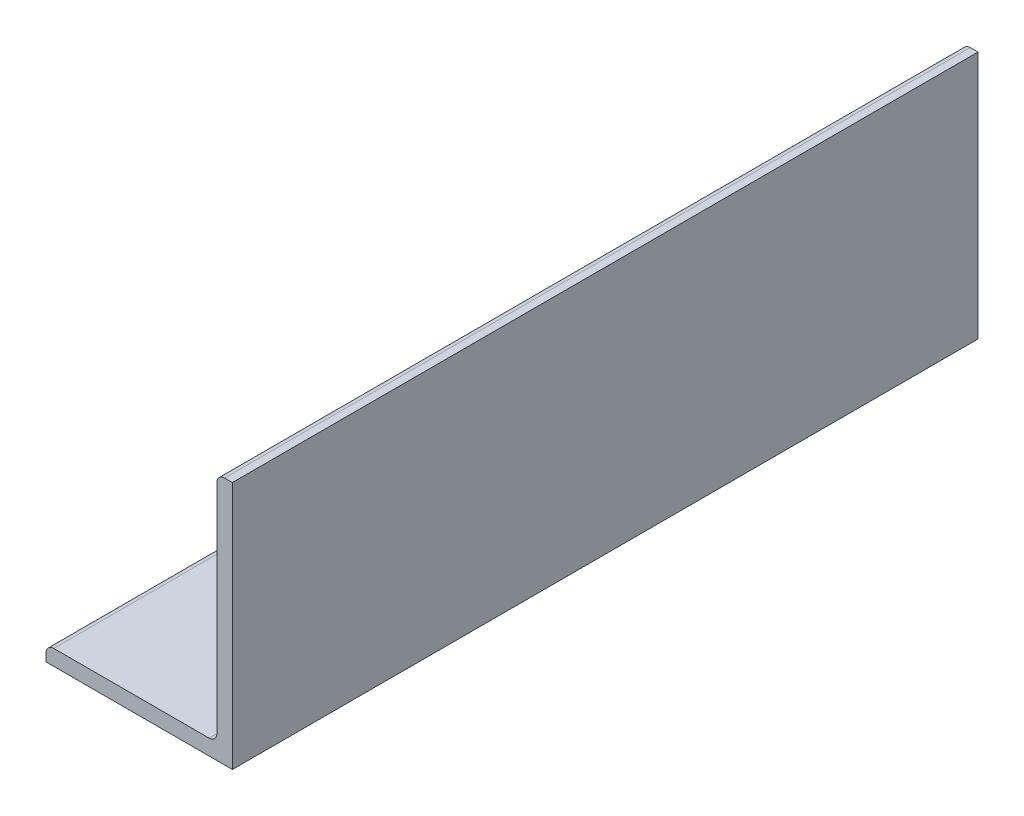
ISO-10303-21;
HEADER;
FILE_DESCRIPTION(('STEP AP214'),'2;1');
FILE_NAME('part.step','',(''),(''),'','','');
FILE_SCHEMA(('AUTOMOTIVE_DESIGN { 1 0 10303 214 1 1 1 1 }'));
ENDSEC;
DATA;
#1=APPLICATION_CONTEXT('core data for automotive mechanical design processes');
#2=APPLICATION_PROTOCOL_DEFINITION('international standard','automotive_design',2000,#1);
#3=PRODUCT_CONTEXT('',#1,'mechanical');
#4=PRODUCT('Part','Part','',(#3));
#5=PRODUCT_RELATED_PRODUCT_CATEGORY('part','',(#4));
#6=PRODUCT_DEFINITION_FORMATION('','',#4);
#7=PRODUCT_DEFINITION_CONTEXT('part definition',#1,'design');
#8=PRODUCT_DEFINITION('design','',#6,#7);
#9=PRODUCT_DEFINITION_SHAPE('','',#8);
#10=(LENGTH_UNIT() NAMED_UNIT(*) SI_UNIT(.MILLI.,.METRE.));
#11=(NAMED_UNIT(*) PLANE_ANGLE_UNIT() SI_UNIT($,.RADIAN.));
#12=(NAMED_UNIT(*) SI_UNIT($,.STERADIAN.) SOLID_ANGLE_UNIT());
#13=UNCERTAINTY_MEASURE_WITH_UNIT(LENGTH_MEASURE(1.E-05),#10,'distance_accuracy_value','');
#14=(GEOMETRIC_REPRESENTATION_CONTEXT(3) GLOBAL_UNCERTAINTY_ASSIGNED_CONTEXT((#13)) GLOBAL_UNIT_ASSIGNED_CONTEXT((#10,
#11,#12)) REPRESENTATION_CONTEXT('',''));
#15=CARTESIAN_POINT('',(0.,0.,0.));
#16=DIRECTION('',(0.,0.,1.));
#17=DIRECTION('',(1.,0.,0.));
#18=AXIS2_PLACEMENT_3D('',#15,#16,#17);
#19=CARTESIAN_POINT('',(-38.1,3.175,152.4));
#20=DIRECTION('',(1.,0.,0.));
#21=DIRECTION('',(0.,0.,-1.));
#22=AXIS2_PLACEMENT_3D('',#19,#20,#21);
#23=PLANE('',#22);
#24=DIRECTION('',(0.,-1.,0.));
#25=VECTOR('',#24,1.);
#26=CARTESIAN_POINT('',(-38.1,3.175,-152.4));
#27=LINE('',#26,#25);
#28=CARTESIAN_POINT('',(-38.1,3.175,-152.4));
#29=VERTEX_POINT('',#28);
#30=CARTESIAN_POINT('',(-38.1,0.,-152.4));
#31=VERTEX_POINT('',#30);
#32=EDGE_CURVE('E134',#29,#31,#27,.T.);
#33=ORIENTED_EDGE('',*,*,#32,.T.);
#34=DIRECTION('',(0.,0.,-1.));
#35=VECTOR('',#34,1.);
#36=CARTESIAN_POINT('',(-38.1,0.,152.4));
#37=LINE('',#36,#35);
#38=CARTESIAN_POINT('',(-38.1,0.,152.4));
#39=VERTEX_POINT('',#38);
#40=EDGE_CURVE('E11',#39,#31,#37,.T.);
#41=ORIENTED_EDGE('',*,*,#40,.F.);
#42=DIRECTION('',(0.,-1.,0.));
#43=VECTOR('',#42,1.);
#44=CARTESIAN_POINT('',(-38.1,3.175,152.4));
#45=LINE('',#44,#43);
#46=CARTESIAN_POINT('',(-38.1,3.175,152.4));
#47=VERTEX_POINT('',#46);
#48=EDGE_CURVE('E150',#47,#39,#45,.T.);
#49=ORIENTED_EDGE('',*,*,#48,.F.);
#50=DIRECTION('',(0.,0.,-1.));
#51=VECTOR('',#50,1.);
#52=CARTESIAN_POINT('',(-38.1,3.175,152.4));
#53=LINE('',#52,#51);
#54=EDGE_CURVE('E130',#47,#29,#53,.T.);
#55=ORIENTED_EDGE('',*,*,#54,.T.);
#56=EDGE_LOOP('',(#33,#41,#49,#55));
#57=FACE_BOUND('',#56,.T.);
#58=ADVANCED_FACE('F32',(#57),#23,.F.);
#59=CARTESIAN_POINT('',(-38.1,0.,152.4));
#60=DIRECTION('',(0.,1.,0.));
#61=DIRECTION('',(0.,0.,1.));
#62=AXIS2_PLACEMENT_3D('',#59,#60,#61);
#63=PLANE('',#62);
#64=DIRECTION('',(1.,0.,0.));
#65=VECTOR('',#64,1.);
#66=CARTESIAN_POINT('',(-38.1,0.,-152.4));
#67=LINE('',#66,#65);
#68=CARTESIAN_POINT('',(38.1,0.,-152.4));
#69=VERTEX_POINT('',#68);
#70=EDGE_CURVE('E137',#31,#69,#67,.T.);
#71=ORIENTED_EDGE('',*,*,#70,.T.);
#72=DIRECTION('',(0.,0.,-1.));
#73=VECTOR('',#72,1.);
#74=CARTESIAN_POINT('',(38.1,0.,152.4));
#75=LINE('',#74,#73);
#76=CARTESIAN_POINT('',(38.1,0.,152.4));
#77=VERTEX_POINT('',#76);
#78=EDGE_CURVE('E40',#77,#69,#75,.T.);
#79=ORIENTED_EDGE('',*,*,#78,.F.);
#80=DIRECTION('',(1.,0.,0.));
#81=VECTOR('',#80,1.);
#82=CARTESIAN_POINT('',(-38.1,0.,152.4));
#83=LINE('',#82,#81);
#84=EDGE_CURVE('E94',#39,#77,#83,.T.);
#85=ORIENTED_EDGE('',*,*,#84,.F.);
#86=ORIENTED_EDGE('',*,*,#40,.T.);
#87=EDGE_LOOP('',(#71,#79,#85,#86));
#88=FACE_BOUND('',#87,.T.);
#89=ADVANCED_FACE('F193',(#88),#63,.F.);
#90=CARTESIAN_POINT('',(38.1,0.,152.4));
#91=DIRECTION('',(-1.,0.,0.));
#92=DIRECTION('',(0.,-1.,0.));
#93=AXIS2_PLACEMENT_3D('',#90,#91,#92);
#94=PLANE('',#93);
#95=DIRECTION('',(0.,1.,0.));
#96=VECTOR('',#95,1.);
#97=CARTESIAN_POINT('',(38.1,0.,-152.4));
#98=LINE('',#97,#96);
#99=CARTESIAN_POINT('',(38.1,101.6,-152.4));
#100=VERTEX_POINT('',#99);
#101=EDGE_CURVE('E139',#69,#100,#98,.T.);
#102=ORIENTED_EDGE('',*,*,#101,.T.);
#103=DIRECTION('',(0.,0.,-1.));
#104=VECTOR('',#103,1.);
#105=CARTESIAN_POINT('',(38.1,101.6,152.4));
#106=LINE('',#105,#104);
#107=CARTESIAN_POINT('',(38.1,101.6,152.4));
#108=VERTEX_POINT('',#107);
#109=EDGE_CURVE('E160',#108,#100,#106,.T.);
#110=ORIENTED_EDGE('',*,*,#109,.F.);
#111=DIRECTION('',(0.,1.,0.));
#112=VECTOR('',#111,1.);
#113=CARTESIAN_POINT('',(38.1,0.,152.4));
#114=LINE('',#113,#112);
#115=EDGE_CURVE('E168',#77,#108,#114,.T.);
#116=ORIENTED_EDGE('',*,*,#115,.F.);
#117=ORIENTED_EDGE('',*,*,#78,.T.);
#118=EDGE_LOOP('',(#102,#110,#116,#117));
#119=FACE_BOUND('',#118,.T.);
#120=ADVANCED_FACE('F166',(#119),#94,.F.);
#121=CARTESIAN_POINT('',(34.925,101.6,152.4));
#122=DIRECTION('',(0.,-1.,0.));
#123=DIRECTION('',(1.,0.,0.));
#124=AXIS2_PLACEMENT_3D('',#121,#122,#123);
#125=PLANE('',#124);
#126=DIRECTION('',(-1.,0.,0.));
#127=VECTOR('',#126,1.);
#128=CARTESIAN_POINT('',(34.925,101.6,-152.4));
#129=LINE('',#128,#127);
#130=CARTESIAN_POINT('',(34.925,101.6,-152.4));
#131=VERTEX_POINT('',#130);
#132=EDGE_CURVE('E141',#100,#131,#129,.T.);
#133=ORIENTED_EDGE('',*,*,#132,.T.);
#134=DIRECTION('',(0.,0.,-1.));
#135=VECTOR('',#134,1.);
#136=CARTESIAN_POINT('',(34.925,101.6,152.4));
#137=LINE('',#136,#135);
#138=CARTESIAN_POINT('',(34.925,101.6,152.4));
#139=VERTEX_POINT('',#138);
#140=EDGE_CURVE('E157',#139,#131,#137,.T.);
#141=ORIENTED_EDGE('',*,*,#140,.F.);
#142=DIRECTION('',(-1.,0.,0.));
#143=VECTOR('',#142,1.);
#144=CARTESIAN_POINT('',(34.925,101.6,152.4));
#145=LINE('',#144,#143);
#146=EDGE_CURVE('E184',#108,#139,#145,.T.);
#147=ORIENTED_EDGE('',*,*,#146,.F.);
#148=ORIENTED_EDGE('',*,*,#109,.T.);
#149=EDGE_LOOP('',(#133,#141,#147,#148));
#150=FACE_BOUND('',#149,.T.);
#151=ADVANCED_FACE('F177',(#150),#125,.F.);
#152=CARTESIAN_POINT('',(34.925,98.425,152.4));
#153=DIRECTION('',(0.,0.,-1.));
#154=DIRECTION('',(-1.,0.,0.));
#155=AXIS2_PLACEMENT_3D('',#152,#153,#154);
#156=CYLINDRICAL_SURFACE('',#155,3.175);
#157=CARTESIAN_POINT('',(34.925,98.425,-152.4));
#158=DIRECTION('',(0.,0.,1.));
#159=DIRECTION('',(-1.,0.,0.));
#160=AXIS2_PLACEMENT_3D('',#157,#158,#159);
#161=CIRCLE('',#160,3.175);
#162=CARTESIAN_POINT('',(31.75,98.425,-152.4));
#163=VERTEX_POINT('',#162);
#164=EDGE_CURVE('E143',#131,#163,#161,.T.);
#165=ORIENTED_EDGE('',*,*,#164,.T.);
#166=DIRECTION('',(0.,0.,-1.));
#167=VECTOR('',#166,1.);
#168=CARTESIAN_POINT('',(31.75,98.425,152.4));
#169=LINE('',#168,#167);
#170=CARTESIAN_POINT('',(31.75,98.425,152.4));
#171=VERTEX_POINT('',#170);
#172=EDGE_CURVE('E154',#171,#163,#169,.T.);
#173=ORIENTED_EDGE('',*,*,#172,.F.);
#174=CARTESIAN_POINT('',(34.925,98.425,152.4));
#175=DIRECTION('',(0.,0.,1.));
#176=DIRECTION('',(-1.,0.,0.));
#177=AXIS2_PLACEMENT_3D('',#174,#175,#176);
#178=CIRCLE('',#177,3.175);
#179=EDGE_CURVE('E183',#139,#171,#178,.T.);
#180=ORIENTED_EDGE('',*,*,#179,.F.);
#181=ORIENTED_EDGE('',*,*,#140,.T.);
#182=EDGE_LOOP('',(#165,#173,#180,#181));
#183=FACE_BOUND('',#182,.T.);
#184=ADVANCED_FACE('F181',(#183),#156,.T.);
#185=CARTESIAN_POINT('',(31.75,98.425,152.4));
#186=DIRECTION('',(1.,0.,0.));
#187=DIRECTION('',(0.,1.,0.));
#188=AXIS2_PLACEMENT_3D('',#185,#186,#187);
#189=PLANE('',#188);
#190=DIRECTION('',(0.,-1.,0.));
#191=VECTOR('',#190,1.);
#192=CARTESIAN_POINT('',(31.75,98.425,-152.4));
#193=LINE('',#192,#191);
#194=CARTESIAN_POINT('',(31.75,9.52499999999999,-152.4));
#195=VERTEX_POINT('',#194);
#196=EDGE_CURVE('E145',#163,#195,#193,.T.);
#197=ORIENTED_EDGE('',*,*,#196,.T.);
#198=DIRECTION('',(0.,0.,-1.));
#199=VECTOR('',#198,1.);
#200=CARTESIAN_POINT('',(31.75,9.52499999999999,152.4));
#201=LINE('',#200,#199);
#202=CARTESIAN_POINT('',(31.75,9.52499999999999,152.4));
#203=VERTEX_POINT('',#202);
#204=EDGE_CURVE('E125',#203,#195,#201,.T.);
#205=ORIENTED_EDGE('',*,*,#204,.F.);
#206=DIRECTION('',(0.,-1.,0.));
#207=VECTOR('',#206,1.);
#208=CARTESIAN_POINT('',(31.75,98.425,152.4));
#209=LINE('',#208,#207);
#210=EDGE_CURVE('E116',#171,#203,#209,.T.);
#211=ORIENTED_EDGE('',*,*,#210,.F.);
#212=ORIENTED_EDGE('',*,*,#172,.T.);
#213=EDGE_LOOP('',(#197,#205,#211,#212));
#214=FACE_BOUND('',#213,.T.);
#215=ADVANCED_FACE('F205',(#214),#189,.F.);
#216=CARTESIAN_POINT('',(28.575,9.52499999999999,152.4));
#217=DIRECTION('',(0.,0.,-1.));
#218=DIRECTION('',(-1.,0.,0.));
#219=AXIS2_PLACEMENT_3D('',#216,#217,#218);
#220=CYLINDRICAL_SURFACE('',#219,3.175);
#221=CARTESIAN_POINT('',(28.575,9.52499999999999,-152.4));
#222=DIRECTION('',(0.,0.,-1.));
#223=DIRECTION('',(-1.,0.,0.));
#224=AXIS2_PLACEMENT_3D('',#221,#222,#223);
#225=CIRCLE('',#224,3.175);
#226=CARTESIAN_POINT('',(28.575,6.35,-152.4));
#227=VERTEX_POINT('',#226);
#228=EDGE_CURVE('E124',#195,#227,#225,.T.);
#229=ORIENTED_EDGE('',*,*,#228,.T.);
#230=DIRECTION('',(0.,0.,-1.));
#231=VECTOR('',#230,1.);
#232=CARTESIAN_POINT('',(28.575,6.35,152.4));
#233=LINE('',#232,#231);
#234=CARTESIAN_POINT('',(28.575,6.35,152.4));
#235=VERTEX_POINT('',#234);
#236=EDGE_CURVE('E121',#235,#227,#233,.T.);
#237=ORIENTED_EDGE('',*,*,#236,.F.);
#238=CARTESIAN_POINT('',(28.575,9.52499999999999,152.4));
#239=DIRECTION('',(0.,0.,-1.));
#240=DIRECTION('',(-1.,0.,0.));
#241=AXIS2_PLACEMENT_3D('',#238,#239,#240);
#242=CIRCLE('',#241,3.175);
#243=EDGE_CURVE('E110',#203,#235,#242,.T.);
#244=ORIENTED_EDGE('',*,*,#243,.F.);
#245=ORIENTED_EDGE('',*,*,#204,.T.);
#246=EDGE_LOOP('',(#229,#237,#244,#245));
#247=FACE_BOUND('',#246,.T.);
#248=ADVANCED_FACE('F122',(#247),#220,.F.);
#249=CARTESIAN_POINT('',(28.575,6.35,152.4));
#250=DIRECTION('',(0.,-1.,0.));
#251=DIRECTION('',(1.,0.,0.));
#252=AXIS2_PLACEMENT_3D('',#249,#250,#251);
#253=PLANE('',#252);
#254=DIRECTION('',(-1.,0.,0.));
#255=VECTOR('',#254,1.);
#256=CARTESIAN_POINT('',(28.575,6.35,-152.4));
#257=LINE('',#256,#255);
#258=CARTESIAN_POINT('',(-34.925,6.34999999999999,-152.4));
#259=VERTEX_POINT('',#258);
#260=EDGE_CURVE('E80',#227,#259,#257,.T.);
#261=ORIENTED_EDGE('',*,*,#260,.T.);
#262=DIRECTION('',(0.,0.,-1.));
#263=VECTOR('',#262,1.);
#264=CARTESIAN_POINT('',(-34.925,6.34999999999999,152.4));
#265=LINE('',#264,#263);
#266=CARTESIAN_POINT('',(-34.925,6.34999999999999,152.4));
#267=VERTEX_POINT('',#266);
#268=EDGE_CURVE('E126',#267,#259,#265,.T.);
#269=ORIENTED_EDGE('',*,*,#268,.F.);
#270=DIRECTION('',(-1.,0.,0.));
#271=VECTOR('',#270,1.);
#272=CARTESIAN_POINT('',(28.575,6.35,152.4));
#273=LINE('',#272,#271);
#274=EDGE_CURVE('E114',#235,#267,#273,.T.);
#275=ORIENTED_EDGE('',*,*,#274,.F.);
#276=ORIENTED_EDGE('',*,*,#236,.T.);
#277=EDGE_LOOP('',(#261,#269,#275,#276));
#278=FACE_BOUND('',#277,.T.);
#279=ADVANCED_FACE('F128',(#278),#253,.F.);
#280=CARTESIAN_POINT('',(-34.925,3.175,152.4));
#281=DIRECTION('',(0.,0.,-1.));
#282=DIRECTION('',(-1.,0.,0.));
#283=AXIS2_PLACEMENT_3D('',#280,#281,#282);
#284=CYLINDRICAL_SURFACE('',#283,3.175);
#285=CARTESIAN_POINT('',(-34.925,3.175,-152.4));
#286=DIRECTION('',(0.,0.,1.));
#287=DIRECTION('',(-1.,0.,0.));
#288=AXIS2_PLACEMENT_3D('',#285,#286,#287);
#289=CIRCLE('',#288,3.175);
#290=EDGE_CURVE('E86',#259,#29,#289,.T.);
#291=ORIENTED_EDGE('',*,*,#290,.T.);
#292=ORIENTED_EDGE('',*,*,#54,.F.);
#293=CARTESIAN_POINT('',(-34.925,3.175,152.4));
#294=DIRECTION('',(0.,0.,1.));
#295=DIRECTION('',(-1.,0.,0.));
#296=AXIS2_PLACEMENT_3D('',#293,#294,#295);
#297=CIRCLE('',#296,3.175);
#298=EDGE_CURVE('E48',#267,#47,#297,.T.);
#299=ORIENTED_EDGE('',*,*,#298,.F.);
#300=ORIENTED_EDGE('',*,*,#268,.T.);
#301=EDGE_LOOP('',(#291,#292,#299,#300));
#302=FACE_BOUND('',#301,.T.);
#303=ADVANCED_FACE('F213',(#302),#284,.T.);
#304=CARTESIAN_POINT('',(34.925,98.425,152.4));
#305=DIRECTION('',(0.,0.,-1.));
#306=DIRECTION('',(-1.,0.,0.));
#307=AXIS2_PLACEMENT_3D('',#304,#305,#306);
#308=PLANE('',#307);
#309=ORIENTED_EDGE('',*,*,#48,.T.);
#310=ORIENTED_EDGE('',*,*,#84,.T.);
#311=ORIENTED_EDGE('',*,*,#115,.T.);
#312=ORIENTED_EDGE('',*,*,#146,.T.);
#313=ORIENTED_EDGE('',*,*,#179,.T.);
#314=ORIENTED_EDGE('',*,*,#210,.T.);
#315=ORIENTED_EDGE('',*,*,#243,.T.);
#316=ORIENTED_EDGE('',*,*,#274,.T.);
#317=ORIENTED_EDGE('',*,*,#298,.T.);
#318=EDGE_LOOP('',(#309,#310,#311,#312,#313,#314,#315,#316,#317));
#319=FACE_BOUND('',#318,.T.);
#320=ADVANCED_FACE('F112',(#319),#308,.F.);
#321=CARTESIAN_POINT('',(34.925,98.425,-152.4));
#322=DIRECTION('',(0.,0.,-1.));
#323=DIRECTION('',(-1.,0.,0.));
#324=AXIS2_PLACEMENT_3D('',#321,#322,#323);
#325=PLANE('',#324);
#326=ORIENTED_EDGE('',*,*,#32,.F.);
#327=ORIENTED_EDGE('',*,*,#290,.F.);
#328=ORIENTED_EDGE('',*,*,#260,.F.);
#329=ORIENTED_EDGE('',*,*,#228,.F.);
#330=ORIENTED_EDGE('',*,*,#196,.F.);
#331=ORIENTED_EDGE('',*,*,#164,.F.);
#332=ORIENTED_EDGE('',*,*,#132,.F.);
#333=ORIENTED_EDGE('',*,*,#101,.F.);
#334=ORIENTED_EDGE('',*,*,#70,.F.);
#335=EDGE_LOOP('',(#326,#327,#328,#329,#330,#331,#332,#333,#334));
#336=FACE_BOUND('',#335,.T.);
#337=ADVANCED_FACE('F172',(#336),#325,.T.);
#338=CLOSED_SHELL('',(#58,#89,#120,#151,#184,#215,#248,#279,#303,#320,#337));
#339=MANIFOLD_SOLID_BREP('B2',#338);
#340=ADVANCED_BREP_SHAPE_REPRESENTATION('',(#18,#339),#14);
#341=SHAPE_DEFINITION_REPRESENTATION(#9,#340);
ENDSEC;
END-ISO-10303-21;
